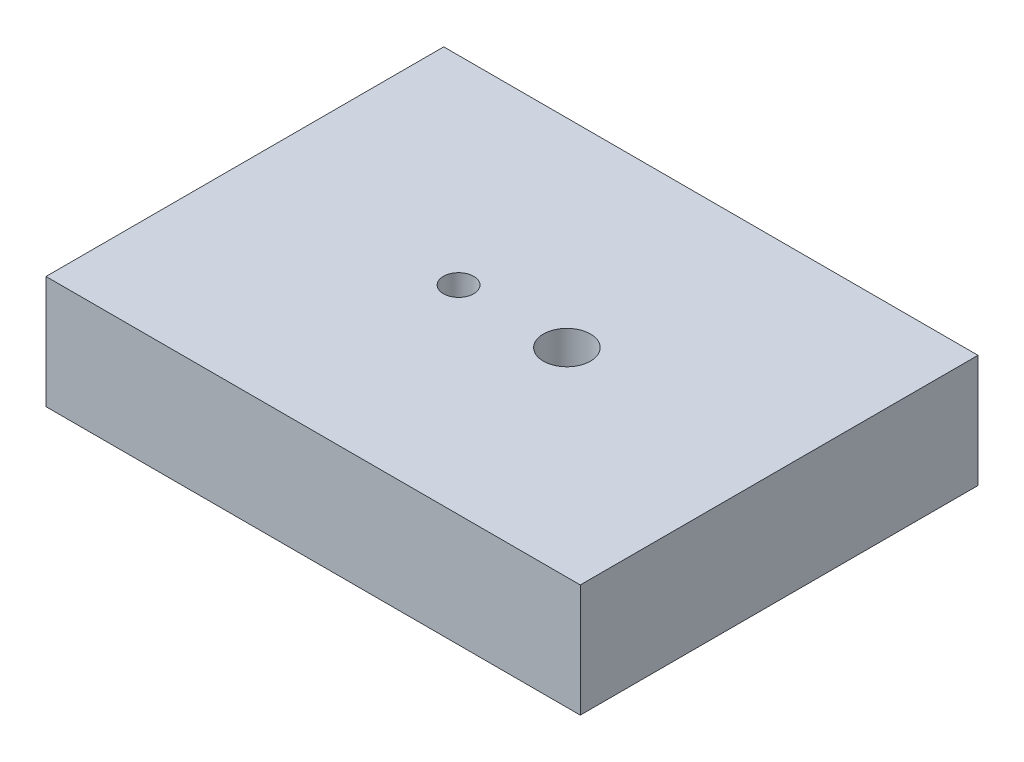
ISO-10303-21;
HEADER;
FILE_DESCRIPTION(('STEP AP214'),'2;1');
FILE_NAME('part.step','',(''),(''),'','','');
FILE_SCHEMA(('AUTOMOTIVE_DESIGN { 1 0 10303 214 1 1 1 1 }'));
ENDSEC;
DATA;
#1=APPLICATION_CONTEXT('core data for automotive mechanical design processes');
#2=APPLICATION_PROTOCOL_DEFINITION('international standard','automotive_design',2000,#1);
#3=PRODUCT_CONTEXT('',#1,'mechanical');
#4=PRODUCT('Part','Part','',(#3));
#5=PRODUCT_RELATED_PRODUCT_CATEGORY('part','',(#4));
#6=PRODUCT_DEFINITION_FORMATION('','',#4);
#7=PRODUCT_DEFINITION_CONTEXT('part definition',#1,'design');
#8=PRODUCT_DEFINITION('design','',#6,#7);
#9=PRODUCT_DEFINITION_SHAPE('','',#8);
#10=(LENGTH_UNIT() NAMED_UNIT(*) SI_UNIT(.MILLI.,.METRE.));
#11=(NAMED_UNIT(*) PLANE_ANGLE_UNIT() SI_UNIT($,.RADIAN.));
#12=(NAMED_UNIT(*) SI_UNIT($,.STERADIAN.) SOLID_ANGLE_UNIT());
#13=UNCERTAINTY_MEASURE_WITH_UNIT(LENGTH_MEASURE(1.E-05),#10,'distance_accuracy_value','');
#14=(GEOMETRIC_REPRESENTATION_CONTEXT(3) GLOBAL_UNCERTAINTY_ASSIGNED_CONTEXT((#13)) GLOBAL_UNIT_ASSIGNED_CONTEXT((#10,
#11,#12)) REPRESENTATION_CONTEXT('',''));
#15=CARTESIAN_POINT('',(0.,0.,0.));
#16=DIRECTION('',(0.,0.,1.));
#17=DIRECTION('',(1.,0.,0.));
#18=AXIS2_PLACEMENT_3D('',#15,#16,#17);
#19=CARTESIAN_POINT('',(0.,19.,0.));
#20=DIRECTION('',(1.,0.,0.));
#21=DIRECTION('',(0.,0.,-1.));
#22=AXIS2_PLACEMENT_3D('',#19,#20,#21);
#23=PLANE('',#22);
#24=DIRECTION('',(0.,0.,1.));
#25=VECTOR('',#24,1.);
#26=CARTESIAN_POINT('',(0.,0.,0.));
#27=LINE('',#26,#25);
#28=CARTESIAN_POINT('',(0.,0.,0.));
#29=VERTEX_POINT('',#28);
#30=CARTESIAN_POINT('',(0.,0.,67.));
#31=VERTEX_POINT('',#30);
#32=EDGE_CURVE('E98',#29,#31,#27,.T.);
#33=ORIENTED_EDGE('',*,*,#32,.T.);
#34=DIRECTION('',(0.,-1.,0.));
#35=VECTOR('',#34,1.);
#36=CARTESIAN_POINT('',(0.,19.,67.));
#37=LINE('',#36,#35);
#38=CARTESIAN_POINT('',(0.,19.,67.));
#39=VERTEX_POINT('',#38);
#40=EDGE_CURVE('E11',#39,#31,#37,.T.);
#41=ORIENTED_EDGE('',*,*,#40,.F.);
#42=DIRECTION('',(0.,0.,1.));
#43=VECTOR('',#42,1.);
#44=CARTESIAN_POINT('',(0.,19.,0.));
#45=LINE('',#44,#43);
#46=CARTESIAN_POINT('',(0.,19.,0.));
#47=VERTEX_POINT('',#46);
#48=EDGE_CURVE('E86',#47,#39,#45,.T.);
#49=ORIENTED_EDGE('',*,*,#48,.F.);
#50=DIRECTION('',(0.,-1.,0.));
#51=VECTOR('',#50,1.);
#52=CARTESIAN_POINT('',(0.,19.,0.));
#53=LINE('',#52,#51);
#54=EDGE_CURVE('E94',#47,#29,#53,.T.);
#55=ORIENTED_EDGE('',*,*,#54,.T.);
#56=EDGE_LOOP('',(#33,#41,#49,#55));
#57=FACE_BOUND('',#56,.T.);
#58=ADVANCED_FACE('F35',(#57),#23,.F.);
#59=CARTESIAN_POINT('',(0.,19.,67.));
#60=DIRECTION('',(0.,0.,-1.));
#61=DIRECTION('',(-1.,0.,0.));
#62=AXIS2_PLACEMENT_3D('',#59,#60,#61);
#63=PLANE('',#62);
#64=DIRECTION('',(1.,0.,0.));
#65=VECTOR('',#64,1.);
#66=CARTESIAN_POINT('',(0.,0.,67.));
#67=LINE('',#66,#65);
#68=CARTESIAN_POINT('',(90.,0.,67.));
#69=VERTEX_POINT('',#68);
#70=EDGE_CURVE('E90',#31,#69,#67,.T.);
#71=ORIENTED_EDGE('',*,*,#70,.T.);
#72=DIRECTION('',(0.,-1.,0.));
#73=VECTOR('',#72,1.);
#74=CARTESIAN_POINT('',(90.,19.,67.));
#75=LINE('',#74,#73);
#76=CARTESIAN_POINT('',(90.,19.,67.));
#77=VERTEX_POINT('',#76);
#78=EDGE_CURVE('E43',#77,#69,#75,.T.);
#79=ORIENTED_EDGE('',*,*,#78,.F.);
#80=DIRECTION('',(1.,0.,0.));
#81=VECTOR('',#80,1.);
#82=CARTESIAN_POINT('',(0.,19.,67.));
#83=LINE('',#82,#81);
#84=EDGE_CURVE('E81',#39,#77,#83,.T.);
#85=ORIENTED_EDGE('',*,*,#84,.F.);
#86=ORIENTED_EDGE('',*,*,#40,.T.);
#87=EDGE_LOOP('',(#71,#79,#85,#86));
#88=FACE_BOUND('',#87,.T.);
#89=ADVANCED_FACE('F89',(#88),#63,.F.);
#90=CARTESIAN_POINT('',(90.,19.,0.));
#91=DIRECTION('',(-1.,0.,0.));
#92=DIRECTION('',(0.,0.,1.));
#93=AXIS2_PLACEMENT_3D('',#90,#91,#92);
#94=PLANE('',#93);
#95=DIRECTION('',(0.,0.,-1.));
#96=VECTOR('',#95,1.);
#97=CARTESIAN_POINT('',(90.,0.,0.));
#98=LINE('',#97,#96);
#99=CARTESIAN_POINT('',(90.,0.,0.));
#100=VERTEX_POINT('',#99);
#101=EDGE_CURVE('E68',#69,#100,#98,.T.);
#102=ORIENTED_EDGE('',*,*,#101,.T.);
#103=DIRECTION('',(0.,-1.,0.));
#104=VECTOR('',#103,1.);
#105=CARTESIAN_POINT('',(90.,19.,0.));
#106=LINE('',#105,#104);
#107=CARTESIAN_POINT('',(90.,19.,0.));
#108=VERTEX_POINT('',#107);
#109=EDGE_CURVE('E91',#108,#100,#106,.T.);
#110=ORIENTED_EDGE('',*,*,#109,.F.);
#111=DIRECTION('',(0.,0.,-1.));
#112=VECTOR('',#111,1.);
#113=CARTESIAN_POINT('',(90.,19.,0.));
#114=LINE('',#113,#112);
#115=EDGE_CURVE('E84',#77,#108,#114,.T.);
#116=ORIENTED_EDGE('',*,*,#115,.F.);
#117=ORIENTED_EDGE('',*,*,#78,.T.);
#118=EDGE_LOOP('',(#102,#110,#116,#117));
#119=FACE_BOUND('',#118,.T.);
#120=ADVANCED_FACE('F92',(#119),#94,.F.);
#121=CARTESIAN_POINT('',(0.,19.,0.));
#122=DIRECTION('',(0.,0.,1.));
#123=DIRECTION('',(1.,0.,0.));
#124=AXIS2_PLACEMENT_3D('',#121,#122,#123);
#125=PLANE('',#124);
#126=DIRECTION('',(-1.,0.,0.));
#127=VECTOR('',#126,1.);
#128=CARTESIAN_POINT('',(0.,0.,0.));
#129=LINE('',#128,#127);
#130=EDGE_CURVE('E74',#100,#29,#129,.T.);
#131=ORIENTED_EDGE('',*,*,#130,.T.);
#132=ORIENTED_EDGE('',*,*,#54,.F.);
#133=DIRECTION('',(-1.,0.,0.));
#134=VECTOR('',#133,1.);
#135=CARTESIAN_POINT('',(0.,19.,0.));
#136=LINE('',#135,#134);
#137=EDGE_CURVE('E51',#108,#47,#136,.T.);
#138=ORIENTED_EDGE('',*,*,#137,.F.);
#139=ORIENTED_EDGE('',*,*,#109,.T.);
#140=EDGE_LOOP('',(#131,#132,#138,#139));
#141=FACE_BOUND('',#140,.T.);
#142=ADVANCED_FACE('F106',(#141),#125,.F.);
#143=CARTESIAN_POINT('',(0.,19.,0.));
#144=DIRECTION('',(0.,1.,0.));
#145=DIRECTION('',(0.,0.,1.));
#146=AXIS2_PLACEMENT_3D('',#143,#144,#145);
#147=PLANE('',#146);
#148=CARTESIAN_POINT('',(54.25,19.,33.5));
#149=DIRECTION('',(0.,-1.,0.));
#150=DIRECTION('',(0.,0.,-1.));
#151=AXIS2_PLACEMENT_3D('',#148,#149,#150);
#152=CIRCLE('',#151,3.96874999999999);
#153=CARTESIAN_POINT('',(54.25,19.,29.53125));
#154=VERTEX_POINT('',#153);
#155=EDGE_CURVE('E117',#154,#154,#152,.T.);
#156=ORIENTED_EDGE('',*,*,#155,.T.);
#157=EDGE_LOOP('',(#156));
#158=FACE_BOUND('',#157,.T.);
#159=CARTESIAN_POINT('',(36.,19.,33.5));
#160=DIRECTION('',(0.,-1.,0.));
#161=DIRECTION('',(0.,0.,-1.));
#162=AXIS2_PLACEMENT_3D('',#159,#160,#161);
#163=CIRCLE('',#162,2.5527);
#164=CARTESIAN_POINT('',(36.,19.,30.9473));
#165=VERTEX_POINT('',#164);
#166=EDGE_CURVE('E101',#165,#165,#163,.T.);
#167=ORIENTED_EDGE('',*,*,#166,.T.);
#168=EDGE_LOOP('',(#167));
#169=FACE_BOUND('',#168,.T.);
#170=ORIENTED_EDGE('',*,*,#48,.T.);
#171=ORIENTED_EDGE('',*,*,#84,.T.);
#172=ORIENTED_EDGE('',*,*,#115,.T.);
#173=ORIENTED_EDGE('',*,*,#137,.T.);
#174=EDGE_LOOP('',(#170,#171,#172,#173));
#175=FACE_BOUND('',#174,.T.);
#176=ADVANCED_FACE('F82',(#158,#169,#175),#147,.T.);
#177=CARTESIAN_POINT('',(0.,0.,0.));
#178=DIRECTION('',(0.,1.,0.));
#179=DIRECTION('',(0.,0.,1.));
#180=AXIS2_PLACEMENT_3D('',#177,#178,#179);
#181=PLANE('',#180);
#182=CARTESIAN_POINT('',(54.25,0.,33.5));
#183=DIRECTION('',(0.,-1.,0.));
#184=DIRECTION('',(0.,0.,-1.));
#185=AXIS2_PLACEMENT_3D('',#182,#183,#184);
#186=CIRCLE('',#185,3.96874999999999);
#187=CARTESIAN_POINT('',(54.25,0.,29.53125));
#188=VERTEX_POINT('',#187);
#189=EDGE_CURVE('E120',#188,#188,#186,.T.);
#190=ORIENTED_EDGE('',*,*,#189,.F.);
#191=EDGE_LOOP('',(#190));
#192=FACE_BOUND('',#191,.T.);
#193=CARTESIAN_POINT('',(36.,0.,33.5));
#194=DIRECTION('',(0.,-1.,0.));
#195=DIRECTION('',(0.,0.,-1.));
#196=AXIS2_PLACEMENT_3D('',#193,#194,#195);
#197=CIRCLE('',#196,2.55269999999999);
#198=CARTESIAN_POINT('',(36.,0.,30.9473));
#199=VERTEX_POINT('',#198);
#200=EDGE_CURVE('E114',#199,#199,#197,.T.);
#201=ORIENTED_EDGE('',*,*,#200,.F.);
#202=EDGE_LOOP('',(#201));
#203=FACE_BOUND('',#202,.T.);
#204=ORIENTED_EDGE('',*,*,#32,.F.);
#205=ORIENTED_EDGE('',*,*,#130,.F.);
#206=ORIENTED_EDGE('',*,*,#101,.F.);
#207=ORIENTED_EDGE('',*,*,#70,.F.);
#208=EDGE_LOOP('',(#204,#205,#206,#207));
#209=FACE_BOUND('',#208,.T.);
#210=ADVANCED_FACE('F109',(#192,#203,#209),#181,.F.);
#211=CARTESIAN_POINT('',(36.,0.,33.5));
#212=DIRECTION('',(0.,-1.,0.));
#213=DIRECTION('',(0.,0.,-1.));
#214=AXIS2_PLACEMENT_3D('',#211,#212,#213);
#215=CYLINDRICAL_SURFACE('',#214,2.55269999999999);
#216=ORIENTED_EDGE('',*,*,#166,.F.);
#217=EDGE_LOOP('',(#216));
#218=FACE_BOUND('',#217,.T.);
#219=ORIENTED_EDGE('',*,*,#200,.T.);
#220=EDGE_LOOP('',(#219));
#221=FACE_BOUND('',#220,.T.);
#222=ADVANCED_FACE('F128',(#218,#221),#215,.F.);
#223=CARTESIAN_POINT('',(54.25,0.,33.5));
#224=DIRECTION('',(0.,-1.,0.));
#225=DIRECTION('',(0.,0.,-1.));
#226=AXIS2_PLACEMENT_3D('',#223,#224,#225);
#227=CYLINDRICAL_SURFACE('',#226,3.96874999999999);
#228=ORIENTED_EDGE('',*,*,#155,.F.);
#229=EDGE_LOOP('',(#228));
#230=FACE_BOUND('',#229,.T.);
#231=ORIENTED_EDGE('',*,*,#189,.T.);
#232=EDGE_LOOP('',(#231));
#233=FACE_BOUND('',#232,.T.);
#234=ADVANCED_FACE('F124',(#230,#233),#227,.F.);
#235=CLOSED_SHELL('',(#58,#89,#120,#142,#176,#210,#222,#234));
#236=MANIFOLD_SOLID_BREP('B2',#235);
#237=ADVANCED_BREP_SHAPE_REPRESENTATION('',(#18,#236),#14);
#238=SHAPE_DEFINITION_REPRESENTATION(#9,#237);
ENDSEC;
END-ISO-10303-21;
